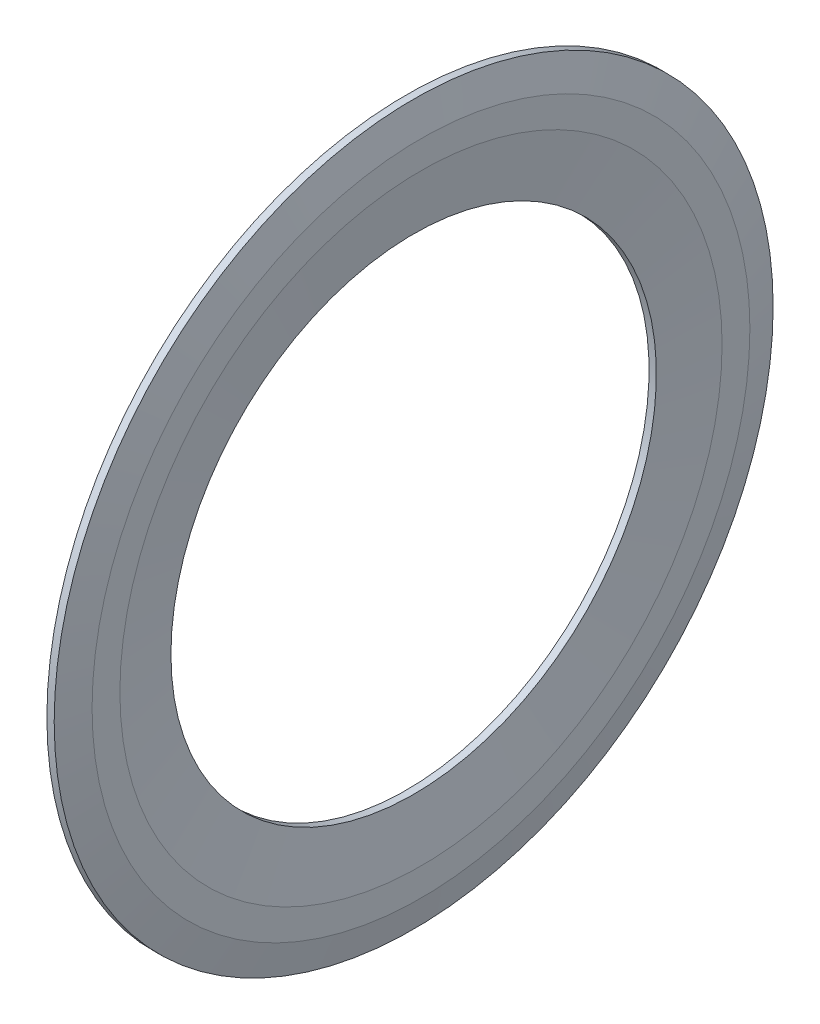
ISO-10303-21;
HEADER;
FILE_DESCRIPTION(('STEP AP214'),'2;1');
FILE_NAME('part.step','',(''),(''),'','','');
FILE_SCHEMA(('AUTOMOTIVE_DESIGN { 1 0 10303 214 1 1 1 1 }'));
ENDSEC;
DATA;
#1=APPLICATION_CONTEXT('core data for automotive mechanical design processes');
#2=APPLICATION_PROTOCOL_DEFINITION('international standard','automotive_design',2000,#1);
#3=PRODUCT_CONTEXT('',#1,'mechanical');
#4=PRODUCT('Part','Part','',(#3));
#5=PRODUCT_RELATED_PRODUCT_CATEGORY('part','',(#4));
#6=PRODUCT_DEFINITION_FORMATION('','',#4);
#7=PRODUCT_DEFINITION_CONTEXT('part definition',#1,'design');
#8=PRODUCT_DEFINITION('design','',#6,#7);
#9=PRODUCT_DEFINITION_SHAPE('','',#8);
#10=(LENGTH_UNIT() NAMED_UNIT(*) SI_UNIT(.MILLI.,.METRE.));
#11=(NAMED_UNIT(*) PLANE_ANGLE_UNIT() SI_UNIT($,.RADIAN.));
#12=(NAMED_UNIT(*) SI_UNIT($,.STERADIAN.) SOLID_ANGLE_UNIT());
#13=UNCERTAINTY_MEASURE_WITH_UNIT(LENGTH_MEASURE(1.E-05),#10,'distance_accuracy_value','');
#14=(GEOMETRIC_REPRESENTATION_CONTEXT(3) GLOBAL_UNCERTAINTY_ASSIGNED_CONTEXT((#13)) GLOBAL_UNIT_ASSIGNED_CONTEXT((#10,
#11,#12)) REPRESENTATION_CONTEXT('',''));
#15=CARTESIAN_POINT('',(0.,0.,0.));
#16=DIRECTION('',(0.,0.,1.));
#17=DIRECTION('',(1.,0.,0.));
#18=AXIS2_PLACEMENT_3D('',#15,#16,#17);
#19=CARTESIAN_POINT('',(0.476602,0.,0.));
#20=DIRECTION('',(-1.,0.,0.));
#21=DIRECTION('',(0.,0.,1.));
#22=AXIS2_PLACEMENT_3D('',#19,#20,#21);
#23=CYLINDRICAL_SURFACE('',#22,5.85);
#24=CARTESIAN_POINT('',(0.357452,0.,0.));
#25=DIRECTION('',(-1.,0.,0.));
#26=DIRECTION('',(0.,0.,1.));
#27=AXIS2_PLACEMENT_3D('',#24,#25,#26);
#28=CIRCLE('',#27,5.85);
#29=CARTESIAN_POINT('',(0.357452,0.,5.85));
#30=VERTEX_POINT('',#29);
#31=EDGE_CURVE('E10',#30,#30,#28,.T.);
#32=ORIENTED_EDGE('',*,*,#31,.F.);
#33=EDGE_LOOP('',(#32));
#34=FACE_BOUND('',#33,.T.);
#35=CARTESIAN_POINT('',(0.476602,0.,0.));
#36=DIRECTION('',(-1.,0.,0.));
#37=DIRECTION('',(0.,0.,1.));
#38=AXIS2_PLACEMENT_3D('',#35,#36,#37);
#39=CIRCLE('',#38,5.85);
#40=CARTESIAN_POINT('',(0.476602,0.,5.85));
#41=VERTEX_POINT('',#40);
#42=EDGE_CURVE('E58',#41,#41,#39,.T.);
#43=ORIENTED_EDGE('',*,*,#42,.T.);
#44=EDGE_LOOP('',(#43));
#45=FACE_BOUND('',#44,.T.);
#46=ADVANCED_FACE('F30',(#34,#45),#23,.T.);
#47=CARTESIAN_POINT('',(0.357452,0.,0.));
#48=DIRECTION('',(-1.,0.,0.));
#49=DIRECTION('',(0.,0.,1.));
#50=AXIS2_PLACEMENT_3D('',#47,#48,#49);
#51=CONICAL_SURFACE('',#50,5.85,1.44602677885603);
#52=CARTESIAN_POINT('',(0.417027,0.,0.));
#53=DIRECTION('',(-1.,0.,0.));
#54=DIRECTION('',(0.,0.,1.));
#55=AXIS2_PLACEMENT_3D('',#52,#53,#54);
#56=CIRCLE('',#55,5.375);
#57=CARTESIAN_POINT('',(0.417027,0.,5.375));
#58=VERTEX_POINT('',#57);
#59=EDGE_CURVE('E36',#58,#58,#56,.T.);
#60=ORIENTED_EDGE('',*,*,#59,.F.);
#61=EDGE_LOOP('',(#60));
#62=FACE_BOUND('',#61,.T.);
#63=ORIENTED_EDGE('',*,*,#31,.T.);
#64=EDGE_LOOP('',(#63));
#65=FACE_BOUND('',#64,.T.);
#66=ADVANCED_FACE('F95',(#62,#65),#51,.F.);
#67=CARTESIAN_POINT('',(0.417027,0.,0.));
#68=DIRECTION('',(1.,0.,0.));
#69=DIRECTION('',(0.,0.,-1.));
#70=AXIS2_PLACEMENT_3D('',#67,#68,#69);
#71=CONICAL_SURFACE('',#70,5.375,1.44602677885603);
#72=CARTESIAN_POINT('',(0.357452,0.,0.));
#73=DIRECTION('',(-1.,0.,0.));
#74=DIRECTION('',(0.,0.,1.));
#75=AXIS2_PLACEMENT_3D('',#72,#73,#74);
#76=CIRCLE('',#75,4.9);
#77=CARTESIAN_POINT('',(0.357452,0.,4.9));
#78=VERTEX_POINT('',#77);
#79=EDGE_CURVE('E40',#78,#78,#76,.T.);
#80=ORIENTED_EDGE('',*,*,#79,.F.);
#81=EDGE_LOOP('',(#80));
#82=FACE_BOUND('',#81,.T.);
#83=ORIENTED_EDGE('',*,*,#59,.T.);
#84=EDGE_LOOP('',(#83));
#85=FACE_BOUND('',#84,.T.);
#86=ADVANCED_FACE('F90',(#82,#85),#71,.T.);
#87=CARTESIAN_POINT('',(0.357452,4.9,0.));
#88=DIRECTION('',(1.,0.,0.));
#89=DIRECTION('',(0.,0.,-1.));
#90=AXIS2_PLACEMENT_3D('',#87,#88,#89);
#91=PLANE('',#90);
#92=CARTESIAN_POINT('',(0.357452,0.,0.));
#93=DIRECTION('',(-1.,0.,0.));
#94=DIRECTION('',(0.,0.,1.));
#95=AXIS2_PLACEMENT_3D('',#92,#93,#94);
#96=CIRCLE('',#95,3.95);
#97=CARTESIAN_POINT('',(0.357452,0.,3.95));
#98=VERTEX_POINT('',#97);
#99=EDGE_CURVE('E44',#98,#98,#96,.T.);
#100=ORIENTED_EDGE('',*,*,#99,.F.);
#101=EDGE_LOOP('',(#100));
#102=FACE_BOUND('',#101,.T.);
#103=ORIENTED_EDGE('',*,*,#79,.T.);
#104=EDGE_LOOP('',(#103));
#105=FACE_BOUND('',#104,.T.);
#106=ADVANCED_FACE('F84',(#102,#105),#91,.F.);
#107=CARTESIAN_POINT('',(0.476602,0.,0.));
#108=DIRECTION('',(-1.,0.,0.));
#109=DIRECTION('',(0.,0.,1.));
#110=AXIS2_PLACEMENT_3D('',#107,#108,#109);
#111=CYLINDRICAL_SURFACE('',#110,3.95);
#112=CARTESIAN_POINT('',(0.476602,0.,0.));
#113=DIRECTION('',(-1.,0.,0.));
#114=DIRECTION('',(0.,0.,1.));
#115=AXIS2_PLACEMENT_3D('',#112,#113,#114);
#116=CIRCLE('',#115,3.95);
#117=CARTESIAN_POINT('',(0.476602,0.,3.95));
#118=VERTEX_POINT('',#117);
#119=EDGE_CURVE('E49',#118,#118,#116,.T.);
#120=ORIENTED_EDGE('',*,*,#119,.F.);
#121=EDGE_LOOP('',(#120));
#122=FACE_BOUND('',#121,.T.);
#123=ORIENTED_EDGE('',*,*,#99,.T.);
#124=EDGE_LOOP('',(#123));
#125=FACE_BOUND('',#124,.T.);
#126=ADVANCED_FACE('F78',(#122,#125),#111,.F.);
#127=CARTESIAN_POINT('',(0.476602,0.,0.));
#128=DIRECTION('',(1.,0.,0.));
#129=DIRECTION('',(0.,0.,-1.));
#130=AXIS2_PLACEMENT_3D('',#127,#128,#129);
#131=CONICAL_SURFACE('',#130,3.95,1.44602677885603);
#132=CARTESIAN_POINT('',(0.595752,0.,0.));
#133=DIRECTION('',(-1.,0.,0.));
#134=DIRECTION('',(0.,0.,1.));
#135=AXIS2_PLACEMENT_3D('',#132,#133,#134);
#136=CIRCLE('',#135,4.9);
#137=CARTESIAN_POINT('',(0.595752,0.,4.9));
#138=VERTEX_POINT('',#137);
#139=EDGE_CURVE('E52',#138,#138,#136,.T.);
#140=ORIENTED_EDGE('',*,*,#139,.F.);
#141=EDGE_LOOP('',(#140));
#142=FACE_BOUND('',#141,.T.);
#143=ORIENTED_EDGE('',*,*,#119,.T.);
#144=EDGE_LOOP('',(#143));
#145=FACE_BOUND('',#144,.T.);
#146=ADVANCED_FACE('F72',(#142,#145),#131,.F.);
#147=CARTESIAN_POINT('',(0.595752,4.9,0.));
#148=DIRECTION('',(-1.,0.,0.));
#149=DIRECTION('',(0.,0.,1.));
#150=AXIS2_PLACEMENT_3D('',#147,#148,#149);
#151=PLANE('',#150);
#152=CARTESIAN_POINT('',(0.595752,0.,0.));
#153=DIRECTION('',(-1.,0.,0.));
#154=DIRECTION('',(0.,0.,1.));
#155=AXIS2_PLACEMENT_3D('',#152,#153,#154);
#156=CIRCLE('',#155,5.3525841223684);
#157=CARTESIAN_POINT('',(0.595752,0.,5.3525841223684));
#158=VERTEX_POINT('',#157);
#159=EDGE_CURVE('E55',#158,#158,#156,.T.);
#160=ORIENTED_EDGE('',*,*,#159,.F.);
#161=EDGE_LOOP('',(#160));
#162=FACE_BOUND('',#161,.T.);
#163=ORIENTED_EDGE('',*,*,#139,.T.);
#164=EDGE_LOOP('',(#163));
#165=FACE_BOUND('',#164,.T.);
#166=ADVANCED_FACE('F66',(#162,#165),#151,.F.);
#167=CARTESIAN_POINT('',(0.595752,0.,0.));
#168=DIRECTION('',(-1.,0.,0.));
#169=DIRECTION('',(0.,0.,1.));
#170=AXIS2_PLACEMENT_3D('',#167,#168,#169);
#171=CONICAL_SURFACE('',#170,5.3525841223684,1.33568823852216);
#172=ORIENTED_EDGE('',*,*,#42,.F.);
#173=EDGE_LOOP('',(#172));
#174=FACE_BOUND('',#173,.T.);
#175=ORIENTED_EDGE('',*,*,#159,.T.);
#176=EDGE_LOOP('',(#175));
#177=FACE_BOUND('',#176,.T.);
#178=ADVANCED_FACE('F63',(#174,#177),#171,.T.);
#179=CLOSED_SHELL('',(#46,#66,#86,#106,#126,#146,#166,#178));
#180=MANIFOLD_SOLID_BREP('B2',#179);
#181=ADVANCED_BREP_SHAPE_REPRESENTATION('',(#18,#180),#14);
#182=SHAPE_DEFINITION_REPRESENTATION(#9,#181);
ENDSEC;
END-ISO-10303-21;
